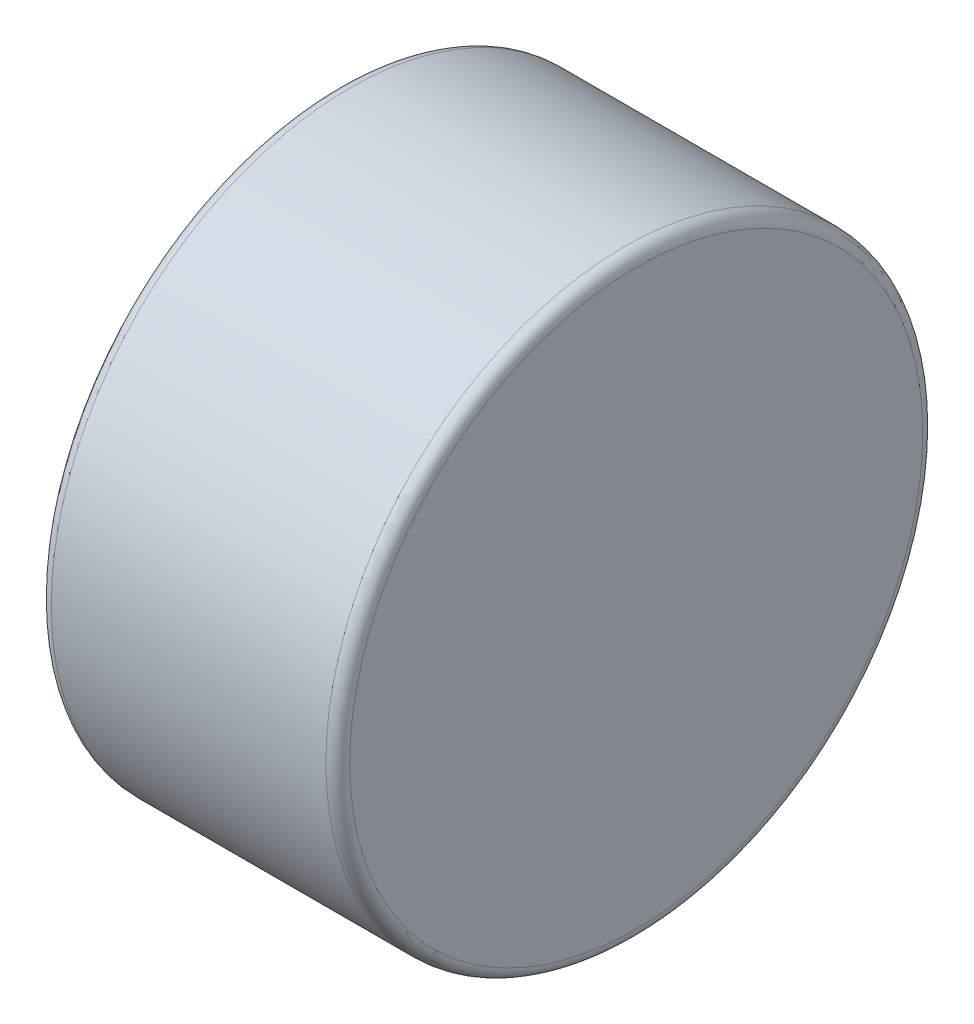
ISO-10303-21;
HEADER;
FILE_DESCRIPTION(('STEP AP214'),'2;1');
FILE_NAME('part.step','',(''),(''),'','','');
FILE_SCHEMA(('AUTOMOTIVE_DESIGN { 1 0 10303 214 1 1 1 1 }'));
ENDSEC;
DATA;
#1=APPLICATION_CONTEXT('core data for automotive mechanical design processes');
#2=APPLICATION_PROTOCOL_DEFINITION('international standard','automotive_design',2000,#1);
#3=PRODUCT_CONTEXT('',#1,'mechanical');
#4=PRODUCT('Part','Part','',(#3));
#5=PRODUCT_RELATED_PRODUCT_CATEGORY('part','',(#4));
#6=PRODUCT_DEFINITION_FORMATION('','',#4);
#7=PRODUCT_DEFINITION_CONTEXT('part definition',#1,'design');
#8=PRODUCT_DEFINITION('design','',#6,#7);
#9=PRODUCT_DEFINITION_SHAPE('','',#8);
#10=(LENGTH_UNIT() NAMED_UNIT(*) SI_UNIT(.MILLI.,.METRE.));
#11=(NAMED_UNIT(*) PLANE_ANGLE_UNIT() SI_UNIT($,.RADIAN.));
#12=(NAMED_UNIT(*) SI_UNIT($,.STERADIAN.) SOLID_ANGLE_UNIT());
#13=UNCERTAINTY_MEASURE_WITH_UNIT(LENGTH_MEASURE(1.E-05),#10,'distance_accuracy_value','');
#14=(GEOMETRIC_REPRESENTATION_CONTEXT(3) GLOBAL_UNCERTAINTY_ASSIGNED_CONTEXT((#13)) GLOBAL_UNIT_ASSIGNED_CONTEXT((#10,
#11,#12)) REPRESENTATION_CONTEXT('',''));
#15=CARTESIAN_POINT('',(0.,0.,0.));
#16=DIRECTION('',(0.,0.,1.));
#17=DIRECTION('',(1.,0.,0.));
#18=AXIS2_PLACEMENT_3D('',#15,#16,#17);
#19=CARTESIAN_POINT('',(2.5,0.,0.));
#20=DIRECTION('',(-1.,0.,0.));
#21=DIRECTION('',(0.,0.,1.));
#22=AXIS2_PLACEMENT_3D('',#19,#20,#21);
#23=CYLINDRICAL_SURFACE('',#22,5.);
#24=CARTESIAN_POINT('',(2.3,0.,0.));
#25=DIRECTION('',(1.,0.,0.));
#26=DIRECTION('',(0.,0.,-1.));
#27=AXIS2_PLACEMENT_3D('',#24,#25,#26);
#28=CIRCLE('',#27,5.);
#29=CARTESIAN_POINT('',(2.3,0.,-5.));
#30=VERTEX_POINT('',#29);
#31=EDGE_CURVE('E42',#30,#30,#28,.F.);
#32=ORIENTED_EDGE('',*,*,#31,.T.);
#33=EDGE_LOOP('',(#32));
#34=FACE_BOUND('',#33,.T.);
#35=CARTESIAN_POINT('',(-2.3,0.,0.));
#36=DIRECTION('',(1.,0.,0.));
#37=DIRECTION('',(0.,0.,-1.));
#38=AXIS2_PLACEMENT_3D('',#35,#36,#37);
#39=CIRCLE('',#38,5.);
#40=CARTESIAN_POINT('',(-2.3,0.,-5.));
#41=VERTEX_POINT('',#40);
#42=EDGE_CURVE('E46',#41,#41,#39,.T.);
#43=ORIENTED_EDGE('',*,*,#42,.T.);
#44=EDGE_LOOP('',(#43));
#45=FACE_BOUND('',#44,.T.);
#46=ADVANCED_FACE('F35',(#34,#45),#23,.T.);
#47=CARTESIAN_POINT('',(2.5,0.,0.));
#48=DIRECTION('',(1.,0.,0.));
#49=DIRECTION('',(0.,0.,-1.));
#50=AXIS2_PLACEMENT_3D('',#47,#48,#49);
#51=PLANE('',#50);
#52=CARTESIAN_POINT('',(2.5,0.,0.));
#53=DIRECTION('',(1.,0.,0.));
#54=DIRECTION('',(0.,0.,-1.));
#55=AXIS2_PLACEMENT_3D('',#52,#53,#54);
#56=CIRCLE('',#55,4.8);
#57=CARTESIAN_POINT('',(2.5,0.,-4.8));
#58=VERTEX_POINT('',#57);
#59=EDGE_CURVE('E50',#58,#58,#56,.T.);
#60=ORIENTED_EDGE('',*,*,#59,.T.);
#61=EDGE_LOOP('',(#60));
#62=FACE_BOUND('',#61,.T.);
#63=ADVANCED_FACE('F56',(#62),#51,.T.);
#64=CARTESIAN_POINT('',(-2.5,0.,0.));
#65=DIRECTION('',(1.,0.,0.));
#66=DIRECTION('',(0.,0.,-1.));
#67=AXIS2_PLACEMENT_3D('',#64,#65,#66);
#68=PLANE('',#67);
#69=CARTESIAN_POINT('',(-2.5,0.,0.));
#70=DIRECTION('',(1.,0.,0.));
#71=DIRECTION('',(0.,0.,-1.));
#72=AXIS2_PLACEMENT_3D('',#69,#70,#71);
#73=CIRCLE('',#72,4.8);
#74=CARTESIAN_POINT('',(-2.5,0.,-4.8));
#75=VERTEX_POINT('',#74);
#76=EDGE_CURVE('E10',#75,#75,#73,.F.);
#77=ORIENTED_EDGE('',*,*,#76,.T.);
#78=EDGE_LOOP('',(#77));
#79=FACE_BOUND('',#78,.T.);
#80=ADVANCED_FACE('F60',(#79),#68,.F.);
#81=CARTESIAN_POINT('',(2.3,0.,0.));
#82=DIRECTION('',(1.,0.,0.));
#83=DIRECTION('',(0.,0.,-1.));
#84=AXIS2_PLACEMENT_3D('',#81,#82,#83);
#85=TOROIDAL_SURFACE('',#84,4.8,0.2);
#86=ORIENTED_EDGE('',*,*,#31,.F.);
#87=EDGE_LOOP('',(#86));
#88=FACE_BOUND('',#87,.T.);
#89=ORIENTED_EDGE('',*,*,#59,.F.);
#90=EDGE_LOOP('',(#89));
#91=FACE_BOUND('',#90,.T.);
#92=ADVANCED_FACE('F58',(#88,#91),#85,.T.);
#93=CARTESIAN_POINT('',(-2.3,0.,0.));
#94=DIRECTION('',(1.,0.,0.));
#95=DIRECTION('',(0.,0.,-1.));
#96=AXIS2_PLACEMENT_3D('',#93,#94,#95);
#97=TOROIDAL_SURFACE('',#96,4.8,0.2);
#98=ORIENTED_EDGE('',*,*,#76,.F.);
#99=EDGE_LOOP('',(#98));
#100=FACE_BOUND('',#99,.T.);
#101=ORIENTED_EDGE('',*,*,#42,.F.);
#102=EDGE_LOOP('',(#101));
#103=FACE_BOUND('',#102,.T.);
#104=ADVANCED_FACE('F37',(#100,#103),#97,.T.);
#105=CLOSED_SHELL('',(#46,#63,#80,#92,#104));
#106=MANIFOLD_SOLID_BREP('B2',#105);
#107=ADVANCED_BREP_SHAPE_REPRESENTATION('',(#18,#106),#14);
#108=SHAPE_DEFINITION_REPRESENTATION(#9,#107);
ENDSEC;
END-ISO-10303-21;
